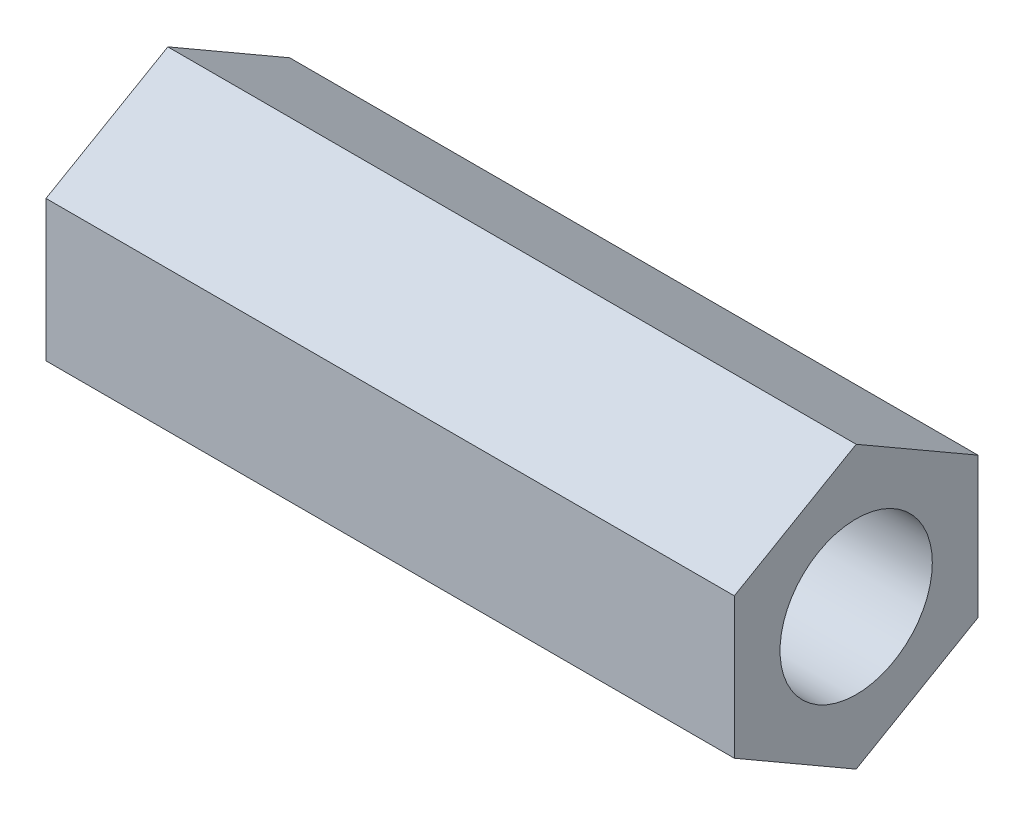
ISO-10303-21;
HEADER;
FILE_DESCRIPTION(('STEP AP214'),'2;1');
FILE_NAME('part.step','',(''),(''),'','','');
FILE_SCHEMA(('AUTOMOTIVE_DESIGN { 1 0 10303 214 1 1 1 1 }'));
ENDSEC;
DATA;
#1=APPLICATION_CONTEXT('core data for automotive mechanical design processes');
#2=APPLICATION_PROTOCOL_DEFINITION('international standard','automotive_design',2000,#1);
#3=PRODUCT_CONTEXT('',#1,'mechanical');
#4=PRODUCT('Part','Part','',(#3));
#5=PRODUCT_RELATED_PRODUCT_CATEGORY('part','',(#4));
#6=PRODUCT_DEFINITION_FORMATION('','',#4);
#7=PRODUCT_DEFINITION_CONTEXT('part definition',#1,'design');
#8=PRODUCT_DEFINITION('design','',#6,#7);
#9=PRODUCT_DEFINITION_SHAPE('','',#8);
#10=(LENGTH_UNIT() NAMED_UNIT(*) SI_UNIT(.MILLI.,.METRE.));
#11=(NAMED_UNIT(*) PLANE_ANGLE_UNIT() SI_UNIT($,.RADIAN.));
#12=(NAMED_UNIT(*) SI_UNIT($,.STERADIAN.) SOLID_ANGLE_UNIT());
#13=UNCERTAINTY_MEASURE_WITH_UNIT(LENGTH_MEASURE(1.E-05),#10,'distance_accuracy_value','');
#14=(GEOMETRIC_REPRESENTATION_CONTEXT(3) GLOBAL_UNCERTAINTY_ASSIGNED_CONTEXT((#13)) GLOBAL_UNIT_ASSIGNED_CONTEXT((#10,
#11,#12)) REPRESENTATION_CONTEXT('',''));
#15=CARTESIAN_POINT('',(0.,0.,0.));
#16=DIRECTION('',(0.,0.,1.));
#17=DIRECTION('',(1.,0.,0.));
#18=AXIS2_PLACEMENT_3D('',#15,#16,#17);
#19=CARTESIAN_POINT('',(22.6,0.,0.));
#20=DIRECTION('',(1.,0.,0.));
#21=DIRECTION('',(0.,0.,-1.));
#22=AXIS2_PLACEMENT_3D('',#19,#20,#21);
#23=PLANE('',#22);
#24=DIRECTION('',(0.,0.5,0.866025403784439));
#25=VECTOR('',#24,1.);
#26=CARTESIAN_POINT('',(22.6,2.30940107675851,-4.));
#27=LINE('',#26,#25);
#28=CARTESIAN_POINT('',(22.6,2.30940107675851,-4.));
#29=VERTEX_POINT('',#28);
#30=CARTESIAN_POINT('',(22.6,4.61880215351701,0.));
#31=VERTEX_POINT('',#30);
#32=EDGE_CURVE('E133',#29,#31,#27,.T.);
#33=ORIENTED_EDGE('',*,*,#32,.T.);
#34=DIRECTION('',(0.,-0.5,0.866025403784439));
#35=VECTOR('',#34,1.);
#36=CARTESIAN_POINT('',(22.6,4.61880215351701,0.));
#37=LINE('',#36,#35);
#38=CARTESIAN_POINT('',(22.6,2.3094010767585,4.));
#39=VERTEX_POINT('',#38);
#40=EDGE_CURVE('E91',#31,#39,#37,.T.);
#41=ORIENTED_EDGE('',*,*,#40,.T.);
#42=DIRECTION('',(0.,-1.,0.));
#43=VECTOR('',#42,1.);
#44=CARTESIAN_POINT('',(22.6,2.3094010767585,4.));
#45=LINE('',#44,#43);
#46=CARTESIAN_POINT('',(22.6,-2.3094010767585,4.));
#47=VERTEX_POINT('',#46);
#48=EDGE_CURVE('E104',#39,#47,#45,.T.);
#49=ORIENTED_EDGE('',*,*,#48,.T.);
#50=DIRECTION('',(0.,-0.5,-0.866025403784439));
#51=VECTOR('',#50,1.);
#52=CARTESIAN_POINT('',(22.6,-2.3094010767585,4.));
#53=LINE('',#52,#51);
#54=CARTESIAN_POINT('',(22.6,-4.61880215351701,0.));
#55=VERTEX_POINT('',#54);
#56=EDGE_CURVE('E98',#47,#55,#53,.T.);
#57=ORIENTED_EDGE('',*,*,#56,.T.);
#58=DIRECTION('',(0.,0.5,-0.866025403784439));
#59=VECTOR('',#58,1.);
#60=CARTESIAN_POINT('',(22.6,-4.61880215351701,0.));
#61=LINE('',#60,#59);
#62=CARTESIAN_POINT('',(22.6,-2.3094010767585,-4.));
#63=VERTEX_POINT('',#62);
#64=EDGE_CURVE('E102',#55,#63,#61,.T.);
#65=ORIENTED_EDGE('',*,*,#64,.T.);
#66=DIRECTION('',(0.,1.,0.));
#67=VECTOR('',#66,1.);
#68=CARTESIAN_POINT('',(22.6,-2.3094010767585,-4.));
#69=LINE('',#68,#67);
#70=EDGE_CURVE('E54',#63,#29,#69,.T.);
#71=ORIENTED_EDGE('',*,*,#70,.T.);
#72=EDGE_LOOP('',(#33,#41,#49,#57,#65,#71));
#73=FACE_BOUND('',#72,.T.);
#74=CARTESIAN_POINT('',(22.6,0.,0.));
#75=DIRECTION('',(1.,0.,0.));
#76=DIRECTION('',(0.,0.,-1.));
#77=AXIS2_PLACEMENT_3D('',#74,#75,#76);
#78=CIRCLE('',#77,2.5);
#79=CARTESIAN_POINT('',(22.6,0.,-2.5));
#80=VERTEX_POINT('',#79);
#81=EDGE_CURVE('E126',#80,#80,#78,.T.);
#82=ORIENTED_EDGE('',*,*,#81,.F.);
#83=EDGE_LOOP('',(#82));
#84=FACE_BOUND('',#83,.T.);
#85=ADVANCED_FACE('F37',(#73,#84),#23,.T.);
#86=CARTESIAN_POINT('',(0.,0.,0.));
#87=DIRECTION('',(1.,0.,0.));
#88=DIRECTION('',(0.,0.,-1.));
#89=AXIS2_PLACEMENT_3D('',#86,#87,#88);
#90=PLANE('',#89);
#91=DIRECTION('',(0.,0.5,0.866025403784439));
#92=VECTOR('',#91,1.);
#93=CARTESIAN_POINT('',(0.,2.30940107675851,-4.));
#94=LINE('',#93,#92);
#95=CARTESIAN_POINT('',(0.,2.30940107675851,-4.));
#96=VERTEX_POINT('',#95);
#97=CARTESIAN_POINT('',(0.,4.61880215351701,0.));
#98=VERTEX_POINT('',#97);
#99=EDGE_CURVE('E122',#96,#98,#94,.T.);
#100=ORIENTED_EDGE('',*,*,#99,.F.);
#101=DIRECTION('',(0.,1.,0.));
#102=VECTOR('',#101,1.);
#103=CARTESIAN_POINT('',(0.,-2.3094010767585,-4.));
#104=LINE('',#103,#102);
#105=CARTESIAN_POINT('',(0.,-2.3094010767585,-4.));
#106=VERTEX_POINT('',#105);
#107=EDGE_CURVE('E83',#106,#96,#104,.T.);
#108=ORIENTED_EDGE('',*,*,#107,.F.);
#109=DIRECTION('',(0.,0.5,-0.866025403784439));
#110=VECTOR('',#109,1.);
#111=CARTESIAN_POINT('',(0.,-4.61880215351701,0.));
#112=LINE('',#111,#110);
#113=CARTESIAN_POINT('',(0.,-4.61880215351701,0.));
#114=VERTEX_POINT('',#113);
#115=EDGE_CURVE('E77',#114,#106,#112,.T.);
#116=ORIENTED_EDGE('',*,*,#115,.F.);
#117=DIRECTION('',(0.,-0.5,-0.866025403784439));
#118=VECTOR('',#117,1.);
#119=CARTESIAN_POINT('',(0.,-2.3094010767585,4.));
#120=LINE('',#119,#118);
#121=CARTESIAN_POINT('',(0.,-2.3094010767585,4.));
#122=VERTEX_POINT('',#121);
#123=EDGE_CURVE('E112',#122,#114,#120,.T.);
#124=ORIENTED_EDGE('',*,*,#123,.F.);
#125=DIRECTION('',(0.,-1.,0.));
#126=VECTOR('',#125,1.);
#127=CARTESIAN_POINT('',(0.,2.3094010767585,4.));
#128=LINE('',#127,#126);
#129=CARTESIAN_POINT('',(0.,2.3094010767585,4.));
#130=VERTEX_POINT('',#129);
#131=EDGE_CURVE('E128',#130,#122,#128,.T.);
#132=ORIENTED_EDGE('',*,*,#131,.F.);
#133=DIRECTION('',(0.,-0.5,0.866025403784439));
#134=VECTOR('',#133,1.);
#135=CARTESIAN_POINT('',(0.,4.61880215351701,0.));
#136=LINE('',#135,#134);
#137=EDGE_CURVE('E125',#98,#130,#136,.T.);
#138=ORIENTED_EDGE('',*,*,#137,.F.);
#139=EDGE_LOOP('',(#100,#108,#116,#124,#132,#138));
#140=FACE_BOUND('',#139,.T.);
#141=CARTESIAN_POINT('',(0.,0.,0.));
#142=DIRECTION('',(1.,0.,0.));
#143=DIRECTION('',(0.,0.,-1.));
#144=AXIS2_PLACEMENT_3D('',#141,#142,#143);
#145=CIRCLE('',#144,2.5);
#146=CARTESIAN_POINT('',(0.,0.,-2.5));
#147=VERTEX_POINT('',#146);
#148=EDGE_CURVE('E226',#147,#147,#145,.T.);
#149=ORIENTED_EDGE('',*,*,#148,.T.);
#150=EDGE_LOOP('',(#149));
#151=FACE_BOUND('',#150,.T.);
#152=ADVANCED_FACE('F142',(#140,#151),#90,.F.);
#153=CARTESIAN_POINT('',(22.6,2.30940107675851,-4.));
#154=DIRECTION('',(0.,-0.866025403784439,0.5));
#155=DIRECTION('',(0.,-0.5,-0.866025403784439));
#156=AXIS2_PLACEMENT_3D('',#153,#154,#155);
#157=PLANE('',#156);
#158=ORIENTED_EDGE('',*,*,#99,.T.);
#159=DIRECTION('',(-1.,0.,0.));
#160=VECTOR('',#159,1.);
#161=CARTESIAN_POINT('',(22.6,4.61880215351701,0.));
#162=LINE('',#161,#160);
#163=EDGE_CURVE('E11',#31,#98,#162,.T.);
#164=ORIENTED_EDGE('',*,*,#163,.F.);
#165=ORIENTED_EDGE('',*,*,#32,.F.);
#166=DIRECTION('',(-1.,0.,0.));
#167=VECTOR('',#166,1.);
#168=CARTESIAN_POINT('',(22.6,2.30940107675851,-4.));
#169=LINE('',#168,#167);
#170=EDGE_CURVE('E118',#29,#96,#169,.T.);
#171=ORIENTED_EDGE('',*,*,#170,.T.);
#172=EDGE_LOOP('',(#158,#164,#165,#171));
#173=FACE_BOUND('',#172,.T.);
#174=ADVANCED_FACE('F39',(#173),#157,.F.);
#175=CARTESIAN_POINT('',(22.6,4.61880215351701,0.));
#176=DIRECTION('',(0.,-0.866025403784439,-0.5));
#177=DIRECTION('',(0.,0.5,-0.866025403784439));
#178=AXIS2_PLACEMENT_3D('',#175,#176,#177);
#179=PLANE('',#178);
#180=ORIENTED_EDGE('',*,*,#137,.T.);
#181=DIRECTION('',(-1.,0.,0.));
#182=VECTOR('',#181,1.);
#183=CARTESIAN_POINT('',(22.6,2.3094010767585,4.));
#184=LINE('',#183,#182);
#185=EDGE_CURVE('E46',#39,#130,#184,.T.);
#186=ORIENTED_EDGE('',*,*,#185,.F.);
#187=ORIENTED_EDGE('',*,*,#40,.F.);
#188=ORIENTED_EDGE('',*,*,#163,.T.);
#189=EDGE_LOOP('',(#180,#186,#187,#188));
#190=FACE_BOUND('',#189,.T.);
#191=ADVANCED_FACE('F167',(#190),#179,.F.);
#192=CARTESIAN_POINT('',(22.6,2.3094010767585,4.));
#193=DIRECTION('',(0.,0.,-1.));
#194=DIRECTION('',(0.,1.,0.));
#195=AXIS2_PLACEMENT_3D('',#192,#193,#194);
#196=PLANE('',#195);
#197=ORIENTED_EDGE('',*,*,#131,.T.);
#198=DIRECTION('',(-1.,0.,0.));
#199=VECTOR('',#198,1.);
#200=CARTESIAN_POINT('',(22.6,-2.3094010767585,4.));
#201=LINE('',#200,#199);
#202=EDGE_CURVE('E113',#47,#122,#201,.T.);
#203=ORIENTED_EDGE('',*,*,#202,.F.);
#204=ORIENTED_EDGE('',*,*,#48,.F.);
#205=ORIENTED_EDGE('',*,*,#185,.T.);
#206=EDGE_LOOP('',(#197,#203,#204,#205));
#207=FACE_BOUND('',#206,.T.);
#208=ADVANCED_FACE('F139',(#207),#196,.F.);
#209=CARTESIAN_POINT('',(22.6,-2.3094010767585,4.));
#210=DIRECTION('',(0.,0.866025403784439,-0.5));
#211=DIRECTION('',(0.,0.5,0.866025403784439));
#212=AXIS2_PLACEMENT_3D('',#209,#210,#211);
#213=PLANE('',#212);
#214=ORIENTED_EDGE('',*,*,#123,.T.);
#215=DIRECTION('',(-1.,0.,0.));
#216=VECTOR('',#215,1.);
#217=CARTESIAN_POINT('',(22.6,-4.61880215351701,0.));
#218=LINE('',#217,#216);
#219=EDGE_CURVE('E109',#55,#114,#218,.T.);
#220=ORIENTED_EDGE('',*,*,#219,.F.);
#221=ORIENTED_EDGE('',*,*,#56,.F.);
#222=ORIENTED_EDGE('',*,*,#202,.T.);
#223=EDGE_LOOP('',(#214,#220,#221,#222));
#224=FACE_BOUND('',#223,.T.);
#225=ADVANCED_FACE('F110',(#224),#213,.F.);
#226=CARTESIAN_POINT('',(22.6,-4.61880215351701,0.));
#227=DIRECTION('',(0.,0.866025403784439,0.5));
#228=DIRECTION('',(0.,-0.5,0.866025403784438));
#229=AXIS2_PLACEMENT_3D('',#226,#227,#228);
#230=PLANE('',#229);
#231=ORIENTED_EDGE('',*,*,#115,.T.);
#232=DIRECTION('',(-1.,0.,0.));
#233=VECTOR('',#232,1.);
#234=CARTESIAN_POINT('',(22.6,-2.3094010767585,-4.));
#235=LINE('',#234,#233);
#236=EDGE_CURVE('E114',#63,#106,#235,.T.);
#237=ORIENTED_EDGE('',*,*,#236,.F.);
#238=ORIENTED_EDGE('',*,*,#64,.F.);
#239=ORIENTED_EDGE('',*,*,#219,.T.);
#240=EDGE_LOOP('',(#231,#237,#238,#239));
#241=FACE_BOUND('',#240,.T.);
#242=ADVANCED_FACE('F116',(#241),#230,.F.);
#243=CARTESIAN_POINT('',(22.6,-2.3094010767585,-4.));
#244=DIRECTION('',(0.,0.,1.));
#245=DIRECTION('',(0.,-1.,0.));
#246=AXIS2_PLACEMENT_3D('',#243,#244,#245);
#247=PLANE('',#246);
#248=ORIENTED_EDGE('',*,*,#107,.T.);
#249=ORIENTED_EDGE('',*,*,#170,.F.);
#250=ORIENTED_EDGE('',*,*,#70,.F.);
#251=ORIENTED_EDGE('',*,*,#236,.T.);
#252=EDGE_LOOP('',(#248,#249,#250,#251));
#253=FACE_BOUND('',#252,.T.);
#254=ADVANCED_FACE('F147',(#253),#247,.F.);
#255=CARTESIAN_POINT('',(22.6,0.,0.));
#256=DIRECTION('',(-1.,0.,0.));
#257=DIRECTION('',(0.,0.,1.));
#258=AXIS2_PLACEMENT_3D('',#255,#256,#257);
#259=CYLINDRICAL_SURFACE('',#258,2.5);
#260=ORIENTED_EDGE('',*,*,#81,.T.);
#261=EDGE_LOOP('',(#260));
#262=FACE_BOUND('',#261,.T.);
#263=ORIENTED_EDGE('',*,*,#148,.F.);
#264=EDGE_LOOP('',(#263));
#265=FACE_BOUND('',#264,.T.);
#266=ADVANCED_FACE('F149',(#262,#265),#259,.F.);
#267=CLOSED_SHELL('',(#85,#152,#174,#191,#208,#225,#242,#254,#266));
#268=MANIFOLD_SOLID_BREP('B2',#267);
#269=ADVANCED_BREP_SHAPE_REPRESENTATION('',(#18,#268),#14);
#270=SHAPE_DEFINITION_REPRESENTATION(#9,#269);
ENDSEC;
END-ISO-10303-21;
